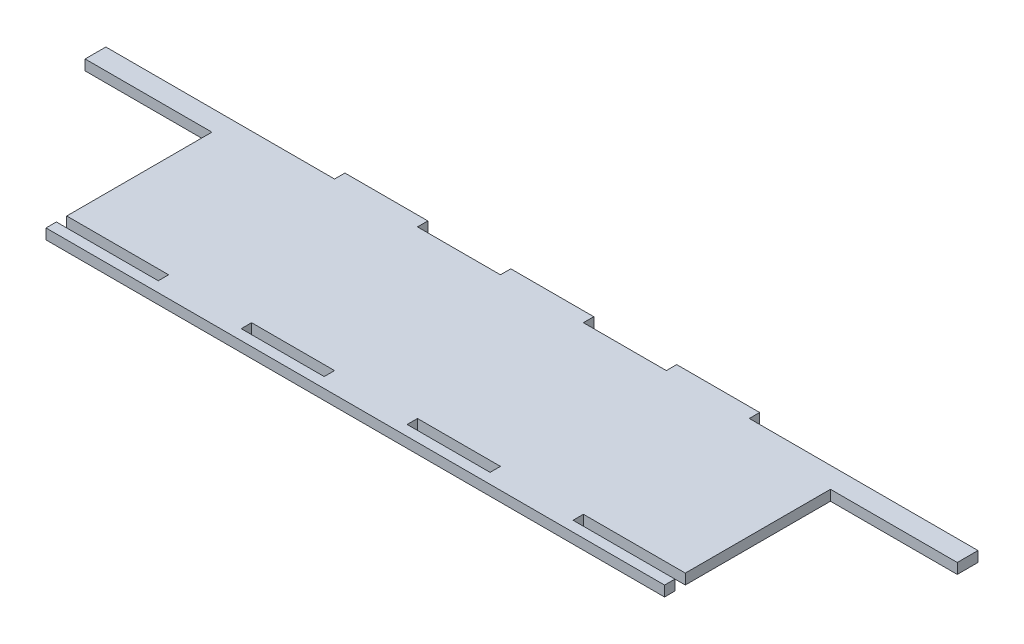
ISO-10303-21;
HEADER;
FILE_DESCRIPTION(('STEP AP214'),'2;1');
FILE_NAME('part.step','',(''),(''),'','','');
FILE_SCHEMA(('AUTOMOTIVE_DESIGN { 1 0 10303 214 1 1 1 1 }'));
ENDSEC;
DATA;
#1=APPLICATION_CONTEXT('core data for automotive mechanical design processes');
#2=APPLICATION_PROTOCOL_DEFINITION('international standard','automotive_design',2000,#1);
#3=PRODUCT_CONTEXT('',#1,'mechanical');
#4=PRODUCT('Part','Part','',(#3));
#5=PRODUCT_RELATED_PRODUCT_CATEGORY('part','',(#4));
#6=PRODUCT_DEFINITION_FORMATION('','',#4);
#7=PRODUCT_DEFINITION_CONTEXT('part definition',#1,'design');
#8=PRODUCT_DEFINITION('design','',#6,#7);
#9=PRODUCT_DEFINITION_SHAPE('','',#8);
#10=(LENGTH_UNIT() NAMED_UNIT(*) SI_UNIT(.MILLI.,.METRE.));
#11=(NAMED_UNIT(*) PLANE_ANGLE_UNIT() SI_UNIT($,.RADIAN.));
#12=(NAMED_UNIT(*) SI_UNIT($,.STERADIAN.) SOLID_ANGLE_UNIT());
#13=UNCERTAINTY_MEASURE_WITH_UNIT(LENGTH_MEASURE(1.E-05),#10,'distance_accuracy_value','');
#14=(GEOMETRIC_REPRESENTATION_CONTEXT(3) GLOBAL_UNCERTAINTY_ASSIGNED_CONTEXT((#13)) GLOBAL_UNIT_ASSIGNED_CONTEXT((#10,
#11,#12)) REPRESENTATION_CONTEXT('',''));
#15=CARTESIAN_POINT('',(0.,0.,0.));
#16=DIRECTION('',(0.,0.,1.));
#17=DIRECTION('',(1.,0.,0.));
#18=AXIS2_PLACEMENT_3D('',#15,#16,#17);
#19=CARTESIAN_POINT('',(0.,3.175,-19.05));
#20=DIRECTION('',(0.,0.,-1.));
#21=DIRECTION('',(-1.,0.,0.));
#22=AXIS2_PLACEMENT_3D('',#19,#20,#21);
#23=PLANE('',#22);
#24=DIRECTION('',(1.,0.,0.));
#25=VECTOR('',#24,1.);
#26=CARTESIAN_POINT('',(0.,0.,-19.05));
#27=LINE('',#26,#25);
#28=CARTESIAN_POINT('',(-133.525,0.,-19.05));
#29=VERTEX_POINT('',#28);
#30=CARTESIAN_POINT('',(-94.7,0.,-19.05));
#31=VERTEX_POINT('',#30);
#32=EDGE_CURVE('E431',#29,#31,#27,.T.);
#33=ORIENTED_EDGE('',*,*,#32,.T.);
#34=DIRECTION('',(0.,-1.,0.));
#35=VECTOR('',#34,1.);
#36=CARTESIAN_POINT('',(-94.7,3.175,-19.05));
#37=LINE('',#36,#35);
#38=CARTESIAN_POINT('',(-94.7,3.175,-19.05));
#39=VERTEX_POINT('',#38);
#40=EDGE_CURVE('E450',#39,#31,#37,.T.);
#41=ORIENTED_EDGE('',*,*,#40,.F.);
#42=DIRECTION('',(1.,0.,0.));
#43=VECTOR('',#42,1.);
#44=CARTESIAN_POINT('',(0.,3.175,-19.05));
#45=LINE('',#44,#43);
#46=CARTESIAN_POINT('',(-133.525,3.175,-19.05));
#47=VERTEX_POINT('',#46);
#48=EDGE_CURVE('E648',#47,#39,#45,.T.);
#49=ORIENTED_EDGE('',*,*,#48,.F.);
#50=DIRECTION('',(0.,-1.,0.));
#51=VECTOR('',#50,1.);
#52=CARTESIAN_POINT('',(-133.525,3.175,-19.05));
#53=LINE('',#52,#51);
#54=EDGE_CURVE('E453',#47,#29,#53,.T.);
#55=ORIENTED_EDGE('',*,*,#54,.T.);
#56=EDGE_LOOP('',(#33,#41,#49,#55));
#57=FACE_BOUND('',#56,.T.);
#58=ADVANCED_FACE('F223',(#57),#23,.F.);
#59=CARTESIAN_POINT('',(0.,3.175,-19.05));
#60=DIRECTION('',(0.,0.,1.));
#61=DIRECTION('',(1.,0.,0.));
#62=AXIS2_PLACEMENT_3D('',#59,#60,#61);
#63=PLANE('',#62);
#64=DIRECTION('',(-1.,0.,0.));
#65=VECTOR('',#64,1.);
#66=CARTESIAN_POINT('',(0.,0.,-19.05));
#67=LINE('',#66,#65);
#68=CARTESIAN_POINT('',(133.525,0.,-19.05));
#69=VERTEX_POINT('',#68);
#70=CARTESIAN_POINT('',(94.7,0.,-19.05));
#71=VERTEX_POINT('',#70);
#72=EDGE_CURVE('E659',#69,#71,#67,.T.);
#73=ORIENTED_EDGE('',*,*,#72,.F.);
#74=DIRECTION('',(0.,-1.,0.));
#75=VECTOR('',#74,1.);
#76=CARTESIAN_POINT('',(133.525,3.175,-19.05));
#77=LINE('',#76,#75);
#78=CARTESIAN_POINT('',(133.525,3.175,-19.05));
#79=VERTEX_POINT('',#78);
#80=EDGE_CURVE('E462',#79,#69,#77,.T.);
#81=ORIENTED_EDGE('',*,*,#80,.F.);
#82=DIRECTION('',(-1.,0.,0.));
#83=VECTOR('',#82,1.);
#84=CARTESIAN_POINT('',(0.,3.175,-19.05));
#85=LINE('',#84,#83);
#86=CARTESIAN_POINT('',(94.7,3.175,-19.05));
#87=VERTEX_POINT('',#86);
#88=EDGE_CURVE('E841',#79,#87,#85,.T.);
#89=ORIENTED_EDGE('',*,*,#88,.T.);
#90=DIRECTION('',(0.,-1.,0.));
#91=VECTOR('',#90,1.);
#92=CARTESIAN_POINT('',(94.7,3.175,-19.05));
#93=LINE('',#92,#91);
#94=EDGE_CURVE('E465',#87,#71,#93,.T.);
#95=ORIENTED_EDGE('',*,*,#94,.T.);
#96=EDGE_LOOP('',(#73,#81,#89,#95));
#97=FACE_BOUND('',#96,.T.);
#98=ADVANCED_FACE('F863',(#97),#63,.T.);
#99=CARTESIAN_POINT('',(133.525,3.175,0.));
#100=DIRECTION('',(-1.,0.,0.));
#101=DIRECTION('',(0.,0.,1.));
#102=AXIS2_PLACEMENT_3D('',#99,#100,#101);
#103=PLANE('',#102);
#104=DIRECTION('',(0.,0.,-1.));
#105=VECTOR('',#104,1.);
#106=CARTESIAN_POINT('',(133.525,0.,0.));
#107=LINE('',#106,#105);
#108=CARTESIAN_POINT('',(133.525,0.,-25.4));
#109=VERTEX_POINT('',#108);
#110=EDGE_CURVE('E428',#69,#109,#107,.T.);
#111=ORIENTED_EDGE('',*,*,#110,.T.);
#112=DIRECTION('',(0.,-1.,0.));
#113=VECTOR('',#112,1.);
#114=CARTESIAN_POINT('',(133.525,3.175,-25.4));
#115=LINE('',#114,#113);
#116=CARTESIAN_POINT('',(133.525,3.175,-25.4));
#117=VERTEX_POINT('',#116);
#118=EDGE_CURVE('E459',#117,#109,#115,.T.);
#119=ORIENTED_EDGE('',*,*,#118,.F.);
#120=DIRECTION('',(0.,0.,-1.));
#121=VECTOR('',#120,1.);
#122=CARTESIAN_POINT('',(133.525,3.175,0.));
#123=LINE('',#122,#121);
#124=EDGE_CURVE('E640',#79,#117,#123,.T.);
#125=ORIENTED_EDGE('',*,*,#124,.F.);
#126=ORIENTED_EDGE('',*,*,#80,.T.);
#127=EDGE_LOOP('',(#111,#119,#125,#126));
#128=FACE_BOUND('',#127,.T.);
#129=ADVANCED_FACE('F677',(#128),#103,.F.);
#130=CARTESIAN_POINT('',(-133.525,3.175,0.));
#131=DIRECTION('',(-1.,0.,0.));
#132=DIRECTION('',(0.,0.,1.));
#133=AXIS2_PLACEMENT_3D('',#130,#131,#132);
#134=PLANE('',#133);
#135=DIRECTION('',(0.,0.,-1.));
#136=VECTOR('',#135,1.);
#137=CARTESIAN_POINT('',(-133.525,0.,0.));
#138=LINE('',#137,#136);
#139=CARTESIAN_POINT('',(-133.525,0.,-25.4));
#140=VERTEX_POINT('',#139);
#141=EDGE_CURVE('E423',#29,#140,#138,.T.);
#142=ORIENTED_EDGE('',*,*,#141,.F.);
#143=ORIENTED_EDGE('',*,*,#54,.F.);
#144=DIRECTION('',(0.,0.,-1.));
#145=VECTOR('',#144,1.);
#146=CARTESIAN_POINT('',(-133.525,3.175,0.));
#147=LINE('',#146,#145);
#148=CARTESIAN_POINT('',(-133.525,3.175,-25.4));
#149=VERTEX_POINT('',#148);
#150=EDGE_CURVE('E644',#47,#149,#147,.T.);
#151=ORIENTED_EDGE('',*,*,#150,.T.);
#152=DIRECTION('',(0.,-1.,0.));
#153=VECTOR('',#152,1.);
#154=CARTESIAN_POINT('',(-133.525,3.175,-25.4));
#155=LINE('',#154,#153);
#156=EDGE_CURVE('E456',#149,#140,#155,.T.);
#157=ORIENTED_EDGE('',*,*,#156,.T.);
#158=EDGE_LOOP('',(#142,#143,#151,#157));
#159=FACE_BOUND('',#158,.T.);
#160=ADVANCED_FACE('F746',(#159),#134,.T.);
#161=CARTESIAN_POINT('',(94.7,3.175,0.));
#162=DIRECTION('',(1.,0.,0.));
#163=DIRECTION('',(0.,0.,-1.));
#164=AXIS2_PLACEMENT_3D('',#161,#162,#163);
#165=PLANE('',#164);
#166=DIRECTION('',(0.,0.,1.));
#167=VECTOR('',#166,1.);
#168=CARTESIAN_POINT('',(94.7,0.,0.));
#169=LINE('',#168,#167);
#170=CARTESIAN_POINT('',(94.7,0.,25.4));
#171=VERTEX_POINT('',#170);
#172=EDGE_CURVE('E532',#71,#171,#169,.T.);
#173=ORIENTED_EDGE('',*,*,#172,.F.);
#174=ORIENTED_EDGE('',*,*,#94,.F.);
#175=DIRECTION('',(0.,0.,1.));
#176=VECTOR('',#175,1.);
#177=CARTESIAN_POINT('',(94.7,3.175,0.));
#178=LINE('',#177,#176);
#179=CARTESIAN_POINT('',(94.7,3.175,25.4));
#180=VERTEX_POINT('',#179);
#181=EDGE_CURVE('E441',#87,#180,#178,.T.);
#182=ORIENTED_EDGE('',*,*,#181,.T.);
#183=DIRECTION('',(0.,-1.,0.));
#184=VECTOR('',#183,1.);
#185=CARTESIAN_POINT('',(94.7,3.175,25.4));
#186=LINE('',#185,#184);
#187=EDGE_CURVE('E443',#180,#171,#186,.T.);
#188=ORIENTED_EDGE('',*,*,#187,.T.);
#189=EDGE_LOOP('',(#173,#174,#182,#188));
#190=FACE_BOUND('',#189,.T.);
#191=ADVANCED_FACE('F838',(#190),#165,.T.);
#192=CARTESIAN_POINT('',(-94.7,3.175,0.));
#193=DIRECTION('',(1.,0.,0.));
#194=DIRECTION('',(0.,0.,-1.));
#195=AXIS2_PLACEMENT_3D('',#192,#193,#194);
#196=PLANE('',#195);
#197=DIRECTION('',(0.,0.,1.));
#198=VECTOR('',#197,1.);
#199=CARTESIAN_POINT('',(-94.7,0.,0.));
#200=LINE('',#199,#198);
#201=CARTESIAN_POINT('',(-94.7,0.,25.4));
#202=VERTEX_POINT('',#201);
#203=EDGE_CURVE('E434',#31,#202,#200,.T.);
#204=ORIENTED_EDGE('',*,*,#203,.T.);
#205=DIRECTION('',(0.,-1.,0.));
#206=VECTOR('',#205,1.);
#207=CARTESIAN_POINT('',(-94.7,3.175,25.4));
#208=LINE('',#207,#206);
#209=CARTESIAN_POINT('',(-94.7,3.175,25.4));
#210=VERTEX_POINT('',#209);
#211=EDGE_CURVE('E446',#210,#202,#208,.T.);
#212=ORIENTED_EDGE('',*,*,#211,.F.);
#213=DIRECTION('',(0.,0.,1.));
#214=VECTOR('',#213,1.);
#215=CARTESIAN_POINT('',(-94.7,3.175,0.));
#216=LINE('',#215,#214);
#217=EDGE_CURVE('E651',#39,#210,#216,.T.);
#218=ORIENTED_EDGE('',*,*,#217,.F.);
#219=ORIENTED_EDGE('',*,*,#40,.T.);
#220=EDGE_LOOP('',(#204,#212,#218,#219));
#221=FACE_BOUND('',#220,.T.);
#222=ADVANCED_FACE('F755',(#221),#196,.F.);
#223=CARTESIAN_POINT('',(0.,0.,0.));
#224=DIRECTION('',(0.,1.,0.));
#225=DIRECTION('',(0.,0.,1.));
#226=AXIS2_PLACEMENT_3D('',#223,#224,#225);
#227=PLANE('',#226);
#228=DIRECTION('',(0.,0.,1.));
#229=VECTOR('',#228,1.);
#230=CARTESIAN_POINT('',(63.5,0.,25.4));
#231=LINE('',#230,#229);
#232=CARTESIAN_POINT('',(63.5,0.,25.4));
#233=VERTEX_POINT('',#232);
#234=CARTESIAN_POINT('',(63.5,0.,28.575));
#235=VERTEX_POINT('',#234);
#236=EDGE_CURVE('E561',#233,#235,#231,.T.);
#237=ORIENTED_EDGE('',*,*,#236,.T.);
#238=DIRECTION('',(1.,0.,0.));
#239=VECTOR('',#238,1.);
#240=CARTESIAN_POINT('',(0.,0.,28.575));
#241=LINE('',#240,#239);
#242=CARTESIAN_POINT('',(94.7,0.,28.575));
#243=VERTEX_POINT('',#242);
#244=EDGE_CURVE('E492',#235,#243,#241,.T.);
#245=ORIENTED_EDGE('',*,*,#244,.T.);
#246=DIRECTION('',(0.,0.,-1.));
#247=VECTOR('',#246,1.);
#248=CARTESIAN_POINT('',(94.7000000000001,0.,4.1392960800001E-13));
#249=LINE('',#248,#247);
#250=CARTESIAN_POINT('',(94.7,0.,31.75));
#251=VERTEX_POINT('',#250);
#252=EDGE_CURVE('E488',#251,#243,#249,.T.);
#253=ORIENTED_EDGE('',*,*,#252,.F.);
#254=DIRECTION('',(1.,0.,0.));
#255=VECTOR('',#254,1.);
#256=CARTESIAN_POINT('',(0.,0.,31.75));
#257=LINE('',#256,#255);
#258=CARTESIAN_POINT('',(-94.7,0.,31.75));
#259=VERTEX_POINT('',#258);
#260=EDGE_CURVE('E485',#259,#251,#257,.T.);
#261=ORIENTED_EDGE('',*,*,#260,.F.);
#262=DIRECTION('',(0.,0.,-1.));
#263=VECTOR('',#262,1.);
#264=CARTESIAN_POINT('',(-94.7000000000001,0.,4.1392960800001E-13));
#265=LINE('',#264,#263);
#266=CARTESIAN_POINT('',(-94.7,0.,28.575));
#267=VERTEX_POINT('',#266);
#268=EDGE_CURVE('E473',#259,#267,#265,.T.);
#269=ORIENTED_EDGE('',*,*,#268,.T.);
#270=CARTESIAN_POINT('',(-63.5,0.,28.575));
#271=VERTEX_POINT('',#270);
#272=EDGE_CURVE('E493',#267,#271,#241,.T.);
#273=ORIENTED_EDGE('',*,*,#272,.T.);
#274=DIRECTION('',(0.,0.,1.));
#275=VECTOR('',#274,1.);
#276=CARTESIAN_POINT('',(-63.5,0.,25.4));
#277=LINE('',#276,#275);
#278=CARTESIAN_POINT('',(-63.5,0.,25.4));
#279=VERTEX_POINT('',#278);
#280=EDGE_CURVE('E512',#279,#271,#277,.T.);
#281=ORIENTED_EDGE('',*,*,#280,.F.);
#282=DIRECTION('',(1.,0.,0.));
#283=VECTOR('',#282,1.);
#284=CARTESIAN_POINT('',(0.,0.,25.4));
#285=LINE('',#284,#283);
#286=EDGE_CURVE('E438',#202,#279,#285,.T.);
#287=ORIENTED_EDGE('',*,*,#286,.F.);
#288=ORIENTED_EDGE('',*,*,#203,.F.);
#289=ORIENTED_EDGE('',*,*,#32,.F.);
#290=ORIENTED_EDGE('',*,*,#141,.T.);
#291=DIRECTION('',(1.,0.,0.));
#292=VECTOR('',#291,1.);
#293=CARTESIAN_POINT('',(0.,0.,-25.4));
#294=LINE('',#293,#292);
#295=CARTESIAN_POINT('',(-63.5,0.,-25.4));
#296=VERTEX_POINT('',#295);
#297=EDGE_CURVE('E371',#140,#296,#294,.T.);
#298=ORIENTED_EDGE('',*,*,#297,.T.);
#299=DIRECTION('',(0.,0.,-1.));
#300=VECTOR('',#299,1.);
#301=CARTESIAN_POINT('',(-63.5,0.,-25.4));
#302=LINE('',#301,#300);
#303=CARTESIAN_POINT('',(-63.5,0.,-28.575));
#304=VERTEX_POINT('',#303);
#305=EDGE_CURVE('E353',#296,#304,#302,.T.);
#306=ORIENTED_EDGE('',*,*,#305,.T.);
#307=DIRECTION('',(1.,0.,0.));
#308=VECTOR('',#307,1.);
#309=CARTESIAN_POINT('',(-63.5,0.,-28.575));
#310=LINE('',#309,#308);
#311=CARTESIAN_POINT('',(-38.1,0.,-28.575));
#312=VERTEX_POINT('',#311);
#313=EDGE_CURVE('E361',#304,#312,#310,.T.);
#314=ORIENTED_EDGE('',*,*,#313,.T.);
#315=DIRECTION('',(0.,0.,-1.));
#316=VECTOR('',#315,1.);
#317=CARTESIAN_POINT('',(-38.1,0.,-25.4));
#318=LINE('',#317,#316);
#319=CARTESIAN_POINT('',(-38.1,0.,-25.4));
#320=VERTEX_POINT('',#319);
#321=EDGE_CURVE('E364',#320,#312,#318,.T.);
#322=ORIENTED_EDGE('',*,*,#321,.F.);
#323=CARTESIAN_POINT('',(-12.7,0.,-25.4));
#324=VERTEX_POINT('',#323);
#325=EDGE_CURVE('E418',#320,#324,#294,.T.);
#326=ORIENTED_EDGE('',*,*,#325,.T.);
#327=DIRECTION('',(0.,0.,-1.));
#328=VECTOR('',#327,1.);
#329=CARTESIAN_POINT('',(-12.7,0.,-25.4));
#330=LINE('',#329,#328);
#331=CARTESIAN_POINT('',(-12.7,0.,-28.575));
#332=VERTEX_POINT('',#331);
#333=EDGE_CURVE('E598',#324,#332,#330,.T.);
#334=ORIENTED_EDGE('',*,*,#333,.T.);
#335=DIRECTION('',(1.,0.,0.));
#336=VECTOR('',#335,1.);
#337=CARTESIAN_POINT('',(-12.7,0.,-28.575));
#338=LINE('',#337,#336);
#339=CARTESIAN_POINT('',(12.7,0.,-28.575));
#340=VERTEX_POINT('',#339);
#341=EDGE_CURVE('E358',#332,#340,#338,.T.);
#342=ORIENTED_EDGE('',*,*,#341,.T.);
#343=DIRECTION('',(0.,0.,-1.));
#344=VECTOR('',#343,1.);
#345=CARTESIAN_POINT('',(12.7,0.,-25.4));
#346=LINE('',#345,#344);
#347=CARTESIAN_POINT('',(12.7,0.,-25.4));
#348=VERTEX_POINT('',#347);
#349=EDGE_CURVE('E604',#348,#340,#346,.T.);
#350=ORIENTED_EDGE('',*,*,#349,.F.);
#351=CARTESIAN_POINT('',(38.1,0.,-25.4));
#352=VERTEX_POINT('',#351);
#353=EDGE_CURVE('E421',#348,#352,#294,.T.);
#354=ORIENTED_EDGE('',*,*,#353,.T.);
#355=DIRECTION('',(0.,0.,-1.));
#356=VECTOR('',#355,1.);
#357=CARTESIAN_POINT('',(38.1,0.,-25.4));
#358=LINE('',#357,#356);
#359=CARTESIAN_POINT('',(38.1,0.,-28.575));
#360=VERTEX_POINT('',#359);
#361=EDGE_CURVE('E576',#352,#360,#358,.T.);
#362=ORIENTED_EDGE('',*,*,#361,.T.);
#363=DIRECTION('',(1.,0.,0.));
#364=VECTOR('',#363,1.);
#365=CARTESIAN_POINT('',(38.1,0.,-28.575));
#366=LINE('',#365,#364);
#367=CARTESIAN_POINT('',(63.5,0.,-28.575));
#368=VERTEX_POINT('',#367);
#369=EDGE_CURVE('E582',#360,#368,#366,.T.);
#370=ORIENTED_EDGE('',*,*,#369,.T.);
#371=DIRECTION('',(0.,0.,-1.));
#372=VECTOR('',#371,1.);
#373=CARTESIAN_POINT('',(63.5,0.,-25.4));
#374=LINE('',#373,#372);
#375=CARTESIAN_POINT('',(63.5,0.,-25.4));
#376=VERTEX_POINT('',#375);
#377=EDGE_CURVE('E585',#376,#368,#374,.T.);
#378=ORIENTED_EDGE('',*,*,#377,.F.);
#379=EDGE_CURVE('E424',#376,#109,#294,.T.);
#380=ORIENTED_EDGE('',*,*,#379,.T.);
#381=ORIENTED_EDGE('',*,*,#110,.F.);
#382=ORIENTED_EDGE('',*,*,#72,.T.);
#383=ORIENTED_EDGE('',*,*,#172,.T.);
#384=EDGE_CURVE('E437',#233,#171,#285,.T.);
#385=ORIENTED_EDGE('',*,*,#384,.F.);
#386=EDGE_LOOP('',(#237,#245,#253,#261,#269,#273,#281,#287,#288,#289,#290,#298,#306,#314,#322,
#326,#334,#342,#350,#354,#362,#370,#378,#380,#381,#382,#383,#385));
#387=FACE_BOUND('',#386,.T.);
#388=DIRECTION('',(0.,0.,1.));
#389=VECTOR('',#388,1.);
#390=CARTESIAN_POINT('',(12.7,0.,25.4));
#391=LINE('',#390,#389);
#392=CARTESIAN_POINT('',(12.7,0.,25.4));
#393=VERTEX_POINT('',#392);
#394=CARTESIAN_POINT('',(12.7,0.,28.575));
#395=VERTEX_POINT('',#394);
#396=EDGE_CURVE('E539',#393,#395,#391,.T.);
#397=ORIENTED_EDGE('',*,*,#396,.T.);
#398=CARTESIAN_POINT('',(38.1,0.,28.575));
#399=VERTEX_POINT('',#398);
#400=EDGE_CURVE('E806',#395,#399,#241,.T.);
#401=ORIENTED_EDGE('',*,*,#400,.T.);
#402=DIRECTION('',(0.,0.,1.));
#403=VECTOR('',#402,1.);
#404=CARTESIAN_POINT('',(38.1,0.,25.4));
#405=LINE('',#404,#403);
#406=CARTESIAN_POINT('',(38.1,0.,25.4));
#407=VERTEX_POINT('',#406);
#408=EDGE_CURVE('E558',#407,#399,#405,.T.);
#409=ORIENTED_EDGE('',*,*,#408,.F.);
#410=EDGE_CURVE('E830',#393,#407,#285,.T.);
#411=ORIENTED_EDGE('',*,*,#410,.F.);
#412=EDGE_LOOP('',(#397,#401,#409,#411));
#413=FACE_BOUND('',#412,.T.);
#414=CARTESIAN_POINT('',(-38.1,0.,28.575));
#415=VERTEX_POINT('',#414);
#416=CARTESIAN_POINT('',(-12.7,0.,28.575));
#417=VERTEX_POINT('',#416);
#418=EDGE_CURVE('E496',#415,#417,#241,.T.);
#419=ORIENTED_EDGE('',*,*,#418,.T.);
#420=DIRECTION('',(0.,0.,1.));
#421=VECTOR('',#420,1.);
#422=CARTESIAN_POINT('',(-12.7,0.,25.4));
#423=LINE('',#422,#421);
#424=CARTESIAN_POINT('',(-12.7,0.,25.4));
#425=VERTEX_POINT('',#424);
#426=EDGE_CURVE('E536',#425,#417,#423,.T.);
#427=ORIENTED_EDGE('',*,*,#426,.F.);
#428=CARTESIAN_POINT('',(-38.1,0.,25.4));
#429=VERTEX_POINT('',#428);
#430=EDGE_CURVE('E442',#429,#425,#285,.T.);
#431=ORIENTED_EDGE('',*,*,#430,.F.);
#432=DIRECTION('',(0.,0.,1.));
#433=VECTOR('',#432,1.);
#434=CARTESIAN_POINT('',(-38.1,0.,25.4));
#435=LINE('',#434,#433);
#436=EDGE_CURVE('E515',#429,#415,#435,.T.);
#437=ORIENTED_EDGE('',*,*,#436,.T.);
#438=EDGE_LOOP('',(#419,#427,#431,#437));
#439=FACE_BOUND('',#438,.T.);
#440=ADVANCED_FACE('F367',(#387,#413,#439),#227,.F.);
#441=CARTESIAN_POINT('',(0.,3.175,0.));
#442=DIRECTION('',(0.,1.,0.));
#443=DIRECTION('',(0.,0.,1.));
#444=AXIS2_PLACEMENT_3D('',#441,#442,#443);
#445=PLANE('',#444);
#446=DIRECTION('',(1.,0.,0.));
#447=VECTOR('',#446,1.);
#448=CARTESIAN_POINT('',(0.,3.175,28.575));
#449=LINE('',#448,#447);
#450=CARTESIAN_POINT('',(63.5,3.175,28.575));
#451=VERTEX_POINT('',#450);
#452=CARTESIAN_POINT('',(94.7,3.175,28.575));
#453=VERTEX_POINT('',#452);
#454=EDGE_CURVE('E476',#451,#453,#449,.T.);
#455=ORIENTED_EDGE('',*,*,#454,.F.);
#456=DIRECTION('',(0.,0.,1.));
#457=VECTOR('',#456,1.);
#458=CARTESIAN_POINT('',(63.5,3.175,25.4));
#459=LINE('',#458,#457);
#460=CARTESIAN_POINT('',(63.5,3.175,25.4));
#461=VERTEX_POINT('',#460);
#462=EDGE_CURVE('E555',#461,#451,#459,.T.);
#463=ORIENTED_EDGE('',*,*,#462,.F.);
#464=DIRECTION('',(1.,0.,0.));
#465=VECTOR('',#464,1.);
#466=CARTESIAN_POINT('',(0.,3.175,25.4));
#467=LINE('',#466,#465);
#468=EDGE_CURVE('E654',#461,#180,#467,.T.);
#469=ORIENTED_EDGE('',*,*,#468,.T.);
#470=ORIENTED_EDGE('',*,*,#181,.F.);
#471=ORIENTED_EDGE('',*,*,#88,.F.);
#472=ORIENTED_EDGE('',*,*,#124,.T.);
#473=DIRECTION('',(1.,0.,0.));
#474=VECTOR('',#473,1.);
#475=CARTESIAN_POINT('',(0.,3.175,-25.4));
#476=LINE('',#475,#474);
#477=CARTESIAN_POINT('',(63.5,3.175,-25.4));
#478=VERTEX_POINT('',#477);
#479=EDGE_CURVE('E637',#478,#117,#476,.T.);
#480=ORIENTED_EDGE('',*,*,#479,.F.);
#481=DIRECTION('',(0.,0.,-1.));
#482=VECTOR('',#481,1.);
#483=CARTESIAN_POINT('',(63.5,3.175,-25.4));
#484=LINE('',#483,#482);
#485=CARTESIAN_POINT('',(63.5,3.175,-28.575));
#486=VERTEX_POINT('',#485);
#487=EDGE_CURVE('E575',#478,#486,#484,.T.);
#488=ORIENTED_EDGE('',*,*,#487,.T.);
#489=DIRECTION('',(1.,0.,0.));
#490=VECTOR('',#489,1.);
#491=CARTESIAN_POINT('',(38.1,3.175,-28.575));
#492=LINE('',#491,#490);
#493=CARTESIAN_POINT('',(38.1,3.175,-28.575));
#494=VERTEX_POINT('',#493);
#495=EDGE_CURVE('E572',#494,#486,#492,.T.);
#496=ORIENTED_EDGE('',*,*,#495,.F.);
#497=DIRECTION('',(0.,0.,-1.));
#498=VECTOR('',#497,1.);
#499=CARTESIAN_POINT('',(38.1,3.175,-25.4));
#500=LINE('',#499,#498);
#501=CARTESIAN_POINT('',(38.1,3.175,-25.4));
#502=VERTEX_POINT('',#501);
#503=EDGE_CURVE('E578',#502,#494,#500,.T.);
#504=ORIENTED_EDGE('',*,*,#503,.F.);
#505=CARTESIAN_POINT('',(12.7,3.175,-25.4));
#506=VERTEX_POINT('',#505);
#507=EDGE_CURVE('E630',#506,#502,#476,.T.);
#508=ORIENTED_EDGE('',*,*,#507,.F.);
#509=DIRECTION('',(0.,0.,-1.));
#510=VECTOR('',#509,1.);
#511=CARTESIAN_POINT('',(12.7,3.175,-25.4));
#512=LINE('',#511,#510);
#513=CARTESIAN_POINT('',(12.7,3.175,-28.575));
#514=VERTEX_POINT('',#513);
#515=EDGE_CURVE('E597',#506,#514,#512,.T.);
#516=ORIENTED_EDGE('',*,*,#515,.T.);
#517=DIRECTION('',(1.,0.,0.));
#518=VECTOR('',#517,1.);
#519=CARTESIAN_POINT('',(-12.7,3.175,-28.575));
#520=LINE('',#519,#518);
#521=CARTESIAN_POINT('',(-12.7,3.175,-28.575));
#522=VERTEX_POINT('',#521);
#523=EDGE_CURVE('E594',#522,#514,#520,.T.);
#524=ORIENTED_EDGE('',*,*,#523,.F.);
#525=DIRECTION('',(0.,0.,-1.));
#526=VECTOR('',#525,1.);
#527=CARTESIAN_POINT('',(-12.7,3.175,-25.4));
#528=LINE('',#527,#526);
#529=CARTESIAN_POINT('',(-12.7,3.175,-25.4));
#530=VERTEX_POINT('',#529);
#531=EDGE_CURVE('E404',#530,#522,#528,.T.);
#532=ORIENTED_EDGE('',*,*,#531,.F.);
#533=CARTESIAN_POINT('',(-38.1,3.175,-25.4));
#534=VERTEX_POINT('',#533);
#535=EDGE_CURVE('E414',#534,#530,#476,.T.);
#536=ORIENTED_EDGE('',*,*,#535,.F.);
#537=DIRECTION('',(0.,0.,-1.));
#538=VECTOR('',#537,1.);
#539=CARTESIAN_POINT('',(-38.1,3.175,-25.4));
#540=LINE('',#539,#538);
#541=CARTESIAN_POINT('',(-38.1,3.175,-28.575));
#542=VERTEX_POINT('',#541);
#543=EDGE_CURVE('E374',#534,#542,#540,.T.);
#544=ORIENTED_EDGE('',*,*,#543,.T.);
#545=DIRECTION('',(1.,0.,0.));
#546=VECTOR('',#545,1.);
#547=CARTESIAN_POINT('',(-63.5,3.175,-28.575));
#548=LINE('',#547,#546);
#549=CARTESIAN_POINT('',(-63.5,3.175,-28.575));
#550=VERTEX_POINT('',#549);
#551=EDGE_CURVE('E372',#550,#542,#548,.T.);
#552=ORIENTED_EDGE('',*,*,#551,.F.);
#553=DIRECTION('',(0.,0.,-1.));
#554=VECTOR('',#553,1.);
#555=CARTESIAN_POINT('',(-63.5,3.175,-25.4));
#556=LINE('',#555,#554);
#557=CARTESIAN_POINT('',(-63.5,3.175,-25.4));
#558=VERTEX_POINT('',#557);
#559=EDGE_CURVE('E356',#558,#550,#556,.T.);
#560=ORIENTED_EDGE('',*,*,#559,.F.);
#561=EDGE_CURVE('E639',#149,#558,#476,.T.);
#562=ORIENTED_EDGE('',*,*,#561,.F.);
#563=ORIENTED_EDGE('',*,*,#150,.F.);
#564=ORIENTED_EDGE('',*,*,#48,.T.);
#565=ORIENTED_EDGE('',*,*,#217,.T.);
#566=CARTESIAN_POINT('',(-63.5,3.175,25.4));
#567=VERTEX_POINT('',#566);
#568=EDGE_CURVE('E447',#210,#567,#467,.T.);
#569=ORIENTED_EDGE('',*,*,#568,.T.);
#570=DIRECTION('',(0.,0.,1.));
#571=VECTOR('',#570,1.);
#572=CARTESIAN_POINT('',(-63.5,3.175,25.4));
#573=LINE('',#572,#571);
#574=CARTESIAN_POINT('',(-63.5,3.175,28.575));
#575=VERTEX_POINT('',#574);
#576=EDGE_CURVE('E489',#567,#575,#573,.T.);
#577=ORIENTED_EDGE('',*,*,#576,.T.);
#578=CARTESIAN_POINT('',(-94.7,3.175,28.575));
#579=VERTEX_POINT('',#578);
#580=EDGE_CURVE('E477',#579,#575,#449,.T.);
#581=ORIENTED_EDGE('',*,*,#580,.F.);
#582=DIRECTION('',(0.,0.,-1.));
#583=VECTOR('',#582,1.);
#584=CARTESIAN_POINT('',(-94.7000000000001,3.175,4.1392960800001E-13));
#585=LINE('',#584,#583);
#586=CARTESIAN_POINT('',(-94.7,3.175,31.75));
#587=VERTEX_POINT('',#586);
#588=EDGE_CURVE('E480',#587,#579,#585,.T.);
#589=ORIENTED_EDGE('',*,*,#588,.F.);
#590=DIRECTION('',(1.,0.,0.));
#591=VECTOR('',#590,1.);
#592=CARTESIAN_POINT('',(0.,3.175,31.75));
#593=LINE('',#592,#591);
#594=CARTESIAN_POINT('',(94.7,3.175,31.75));
#595=VERTEX_POINT('',#594);
#596=EDGE_CURVE('E469',#587,#595,#593,.T.);
#597=ORIENTED_EDGE('',*,*,#596,.T.);
#598=DIRECTION('',(0.,0.,-1.));
#599=VECTOR('',#598,1.);
#600=CARTESIAN_POINT('',(94.7000000000001,3.175,4.1392960800001E-13));
#601=LINE('',#600,#599);
#602=EDGE_CURVE('E472',#595,#453,#601,.T.);
#603=ORIENTED_EDGE('',*,*,#602,.T.);
#604=EDGE_LOOP('',(#455,#463,#469,#470,#471,#472,#480,#488,#496,#504,#508,#516,#524,#532,#536,
#544,#552,#560,#562,#563,#564,#565,#569,#577,#581,#589,#597,#603));
#605=FACE_BOUND('',#604,.T.);
#606=CARTESIAN_POINT('',(12.7,3.175,28.575));
#607=VERTEX_POINT('',#606);
#608=CARTESIAN_POINT('',(38.1,3.175,28.575));
#609=VERTEX_POINT('',#608);
#610=EDGE_CURVE('E784',#607,#609,#449,.T.);
#611=ORIENTED_EDGE('',*,*,#610,.F.);
#612=DIRECTION('',(0.,0.,1.));
#613=VECTOR('',#612,1.);
#614=CARTESIAN_POINT('',(12.7,3.175,25.4));
#615=LINE('',#614,#613);
#616=CARTESIAN_POINT('',(12.7,3.175,25.4));
#617=VERTEX_POINT('',#616);
#618=EDGE_CURVE('E533',#617,#607,#615,.T.);
#619=ORIENTED_EDGE('',*,*,#618,.F.);
#620=CARTESIAN_POINT('',(38.1,3.175,25.4));
#621=VERTEX_POINT('',#620);
#622=EDGE_CURVE('E820',#617,#621,#467,.T.);
#623=ORIENTED_EDGE('',*,*,#622,.T.);
#624=DIRECTION('',(0.,0.,1.));
#625=VECTOR('',#624,1.);
#626=CARTESIAN_POINT('',(38.1,3.175,25.4));
#627=LINE('',#626,#625);
#628=EDGE_CURVE('E542',#621,#609,#627,.T.);
#629=ORIENTED_EDGE('',*,*,#628,.T.);
#630=EDGE_LOOP('',(#611,#619,#623,#629));
#631=FACE_BOUND('',#630,.T.);
#632=DIRECTION('',(0.,0.,1.));
#633=VECTOR('',#632,1.);
#634=CARTESIAN_POINT('',(-12.7,3.175,25.4));
#635=LINE('',#634,#633);
#636=CARTESIAN_POINT('',(-12.7,3.175,25.4));
#637=VERTEX_POINT('',#636);
#638=CARTESIAN_POINT('',(-12.7,3.175,28.575));
#639=VERTEX_POINT('',#638);
#640=EDGE_CURVE('E518',#637,#639,#635,.T.);
#641=ORIENTED_EDGE('',*,*,#640,.T.);
#642=CARTESIAN_POINT('',(-38.1,3.175,28.575));
#643=VERTEX_POINT('',#642);
#644=EDGE_CURVE('E481',#643,#639,#449,.T.);
#645=ORIENTED_EDGE('',*,*,#644,.F.);
#646=DIRECTION('',(0.,0.,1.));
#647=VECTOR('',#646,1.);
#648=CARTESIAN_POINT('',(-38.1,3.175,25.4));
#649=LINE('',#648,#647);
#650=CARTESIAN_POINT('',(-38.1,3.175,25.4));
#651=VERTEX_POINT('',#650);
#652=EDGE_CURVE('E509',#651,#643,#649,.T.);
#653=ORIENTED_EDGE('',*,*,#652,.F.);
#654=EDGE_CURVE('E657',#651,#637,#467,.T.);
#655=ORIENTED_EDGE('',*,*,#654,.T.);
#656=EDGE_LOOP('',(#641,#645,#653,#655));
#657=FACE_BOUND('',#656,.T.);
#658=ADVANCED_FACE('F410',(#605,#631,#657),#445,.T.);
#659=CARTESIAN_POINT('',(0.,3.175,25.4));
#660=DIRECTION('',(0.,0.,-1.));
#661=DIRECTION('',(-1.,0.,0.));
#662=AXIS2_PLACEMENT_3D('',#659,#660,#661);
#663=PLANE('',#662);
#664=DIRECTION('',(0.,-1.,0.));
#665=VECTOR('',#664,1.);
#666=CARTESIAN_POINT('',(-12.7,3.175,25.4));
#667=LINE('',#666,#665);
#668=EDGE_CURVE('E548',#637,#425,#667,.T.);
#669=ORIENTED_EDGE('',*,*,#668,.F.);
#670=ORIENTED_EDGE('',*,*,#654,.F.);
#671=DIRECTION('',(0.,-1.,0.));
#672=VECTOR('',#671,1.);
#673=CARTESIAN_POINT('',(-38.1,3.175,25.4));
#674=LINE('',#673,#672);
#675=EDGE_CURVE('E468',#651,#429,#674,.T.);
#676=ORIENTED_EDGE('',*,*,#675,.T.);
#677=ORIENTED_EDGE('',*,*,#430,.T.);
#678=EDGE_LOOP('',(#669,#670,#676,#677));
#679=FACE_BOUND('',#678,.T.);
#680=ADVANCED_FACE('F1102',(#679),#663,.F.);
#681=DIRECTION('',(0.,-1.,0.));
#682=VECTOR('',#681,1.);
#683=CARTESIAN_POINT('',(-63.5,3.175,25.4));
#684=LINE('',#683,#682);
#685=EDGE_CURVE('E525',#567,#279,#684,.T.);
#686=ORIENTED_EDGE('',*,*,#685,.F.);
#687=ORIENTED_EDGE('',*,*,#568,.F.);
#688=ORIENTED_EDGE('',*,*,#211,.T.);
#689=ORIENTED_EDGE('',*,*,#286,.T.);
#690=EDGE_LOOP('',(#686,#687,#688,#689));
#691=FACE_BOUND('',#690,.T.);
#692=ADVANCED_FACE('F759',(#691),#663,.F.);
#693=DIRECTION('',(0.,-1.,0.));
#694=VECTOR('',#693,1.);
#695=CARTESIAN_POINT('',(38.1,3.175,25.4));
#696=LINE('',#695,#694);
#697=EDGE_CURVE('E381',#621,#407,#696,.T.);
#698=ORIENTED_EDGE('',*,*,#697,.F.);
#699=ORIENTED_EDGE('',*,*,#622,.F.);
#700=DIRECTION('',(0.,-1.,0.));
#701=VECTOR('',#700,1.);
#702=CARTESIAN_POINT('',(12.7,3.175,25.4));
#703=LINE('',#702,#701);
#704=EDGE_CURVE('E528',#617,#393,#703,.T.);
#705=ORIENTED_EDGE('',*,*,#704,.T.);
#706=ORIENTED_EDGE('',*,*,#410,.T.);
#707=EDGE_LOOP('',(#698,#699,#705,#706));
#708=FACE_BOUND('',#707,.T.);
#709=ADVANCED_FACE('F826',(#708),#663,.F.);
#710=ORIENTED_EDGE('',*,*,#468,.F.);
#711=DIRECTION('',(0.,-1.,0.));
#712=VECTOR('',#711,1.);
#713=CARTESIAN_POINT('',(63.5,3.175,25.4));
#714=LINE('',#713,#712);
#715=EDGE_CURVE('E551',#461,#233,#714,.T.);
#716=ORIENTED_EDGE('',*,*,#715,.T.);
#717=ORIENTED_EDGE('',*,*,#384,.T.);
#718=ORIENTED_EDGE('',*,*,#187,.F.);
#719=EDGE_LOOP('',(#710,#716,#717,#718));
#720=FACE_BOUND('',#719,.T.);
#721=ADVANCED_FACE('F818',(#720),#663,.F.);
#722=CARTESIAN_POINT('',(0.,3.175,-25.4));
#723=DIRECTION('',(0.,0.,-1.));
#724=DIRECTION('',(-1.,0.,0.));
#725=AXIS2_PLACEMENT_3D('',#722,#723,#724);
#726=PLANE('',#725);
#727=ORIENTED_EDGE('',*,*,#561,.T.);
#728=DIRECTION('',(0.,-1.,0.));
#729=VECTOR('',#728,1.);
#730=CARTESIAN_POINT('',(-63.5,3.175,-25.4));
#731=LINE('',#730,#729);
#732=EDGE_CURVE('E378',#558,#296,#731,.T.);
#733=ORIENTED_EDGE('',*,*,#732,.T.);
#734=ORIENTED_EDGE('',*,*,#297,.F.);
#735=ORIENTED_EDGE('',*,*,#156,.F.);
#736=EDGE_LOOP('',(#727,#733,#734,#735));
#737=FACE_BOUND('',#736,.T.);
#738=ADVANCED_FACE('F741',(#737),#726,.T.);
#739=ORIENTED_EDGE('',*,*,#535,.T.);
#740=DIRECTION('',(0.,-1.,0.));
#741=VECTOR('',#740,1.);
#742=CARTESIAN_POINT('',(-12.7,3.175,-25.4));
#743=LINE('',#742,#741);
#744=EDGE_CURVE('E383',#530,#324,#743,.T.);
#745=ORIENTED_EDGE('',*,*,#744,.T.);
#746=ORIENTED_EDGE('',*,*,#325,.F.);
#747=DIRECTION('',(0.,-1.,0.));
#748=VECTOR('',#747,1.);
#749=CARTESIAN_POINT('',(-38.1,3.175,-25.4));
#750=LINE('',#749,#748);
#751=EDGE_CURVE('E380',#534,#320,#750,.T.);
#752=ORIENTED_EDGE('',*,*,#751,.F.);
#753=EDGE_LOOP('',(#739,#745,#746,#752));
#754=FACE_BOUND('',#753,.T.);
#755=ADVANCED_FACE('F420',(#754),#726,.T.);
#756=ORIENTED_EDGE('',*,*,#507,.T.);
#757=DIRECTION('',(0.,-1.,0.));
#758=VECTOR('',#757,1.);
#759=CARTESIAN_POINT('',(38.1,3.175,-25.4));
#760=LINE('',#759,#758);
#761=EDGE_CURVE('E233',#502,#352,#760,.T.);
#762=ORIENTED_EDGE('',*,*,#761,.T.);
#763=ORIENTED_EDGE('',*,*,#353,.F.);
#764=DIRECTION('',(0.,-1.,0.));
#765=VECTOR('',#764,1.);
#766=CARTESIAN_POINT('',(12.7,3.175,-25.4));
#767=LINE('',#766,#765);
#768=EDGE_CURVE('E389',#506,#348,#767,.T.);
#769=ORIENTED_EDGE('',*,*,#768,.F.);
#770=EDGE_LOOP('',(#756,#762,#763,#769));
#771=FACE_BOUND('',#770,.T.);
#772=ADVANCED_FACE('F628',(#771),#726,.T.);
#773=DIRECTION('',(0.,-1.,0.));
#774=VECTOR('',#773,1.);
#775=CARTESIAN_POINT('',(63.5,3.175,-25.4));
#776=LINE('',#775,#774);
#777=EDGE_CURVE('E12',#478,#376,#776,.T.);
#778=ORIENTED_EDGE('',*,*,#777,.F.);
#779=ORIENTED_EDGE('',*,*,#479,.T.);
#780=ORIENTED_EDGE('',*,*,#118,.T.);
#781=ORIENTED_EDGE('',*,*,#379,.F.);
#782=EDGE_LOOP('',(#778,#779,#780,#781));
#783=FACE_BOUND('',#782,.T.);
#784=ADVANCED_FACE('F672',(#783),#726,.T.);
#785=CARTESIAN_POINT('',(0.,3.175,31.75));
#786=DIRECTION('',(0.,0.,-1.));
#787=DIRECTION('',(-1.,0.,0.));
#788=AXIS2_PLACEMENT_3D('',#785,#786,#787);
#789=PLANE('',#788);
#790=ORIENTED_EDGE('',*,*,#260,.T.);
#791=DIRECTION('',(0.,-1.,0.));
#792=VECTOR('',#791,1.);
#793=CARTESIAN_POINT('',(94.7,3.175,31.75));
#794=LINE('',#793,#792);
#795=EDGE_CURVE('E505',#595,#251,#794,.T.);
#796=ORIENTED_EDGE('',*,*,#795,.F.);
#797=ORIENTED_EDGE('',*,*,#596,.F.);
#798=DIRECTION('',(0.,-1.,0.));
#799=VECTOR('',#798,1.);
#800=CARTESIAN_POINT('',(-94.7,3.175,31.75));
#801=LINE('',#800,#799);
#802=EDGE_CURVE('E484',#587,#259,#801,.T.);
#803=ORIENTED_EDGE('',*,*,#802,.T.);
#804=EDGE_LOOP('',(#790,#796,#797,#803));
#805=FACE_BOUND('',#804,.T.);
#806=ADVANCED_FACE('F776',(#805),#789,.F.);
#807=CARTESIAN_POINT('',(94.7000000000001,3.175,4.1392960800001E-13));
#808=DIRECTION('',(-1.,0.,0.));
#809=DIRECTION('',(0.,0.,1.));
#810=AXIS2_PLACEMENT_3D('',#807,#808,#809);
#811=PLANE('',#810);
#812=ORIENTED_EDGE('',*,*,#252,.T.);
#813=DIRECTION('',(0.,-1.,0.));
#814=VECTOR('',#813,1.);
#815=CARTESIAN_POINT('',(94.7,3.175,28.575));
#816=LINE('',#815,#814);
#817=EDGE_CURVE('E502',#453,#243,#816,.T.);
#818=ORIENTED_EDGE('',*,*,#817,.F.);
#819=ORIENTED_EDGE('',*,*,#602,.F.);
#820=ORIENTED_EDGE('',*,*,#795,.T.);
#821=EDGE_LOOP('',(#812,#818,#819,#820));
#822=FACE_BOUND('',#821,.T.);
#823=ADVANCED_FACE('F779',(#822),#811,.F.);
#824=CARTESIAN_POINT('',(-94.7000000000001,3.175,4.1392960800001E-13));
#825=DIRECTION('',(-1.,0.,0.));
#826=DIRECTION('',(0.,0.,1.));
#827=AXIS2_PLACEMENT_3D('',#824,#825,#826);
#828=PLANE('',#827);
#829=ORIENTED_EDGE('',*,*,#268,.F.);
#830=ORIENTED_EDGE('',*,*,#802,.F.);
#831=ORIENTED_EDGE('',*,*,#588,.T.);
#832=DIRECTION('',(0.,-1.,0.));
#833=VECTOR('',#832,1.);
#834=CARTESIAN_POINT('',(-94.7,3.175,28.575));
#835=LINE('',#834,#833);
#836=EDGE_CURVE('E500',#579,#267,#835,.T.);
#837=ORIENTED_EDGE('',*,*,#836,.T.);
#838=EDGE_LOOP('',(#829,#830,#831,#837));
#839=FACE_BOUND('',#838,.T.);
#840=ADVANCED_FACE('F771',(#839),#828,.T.);
#841=CARTESIAN_POINT('',(0.,3.175,28.575));
#842=DIRECTION('',(0.,0.,-1.));
#843=DIRECTION('',(-1.,0.,0.));
#844=AXIS2_PLACEMENT_3D('',#841,#842,#843);
#845=PLANE('',#844);
#846=ORIENTED_EDGE('',*,*,#580,.T.);
#847=DIRECTION('',(0.,-1.,0.));
#848=VECTOR('',#847,1.);
#849=CARTESIAN_POINT('',(-63.5,3.175,28.575));
#850=LINE('',#849,#848);
#851=EDGE_CURVE('E521',#575,#271,#850,.T.);
#852=ORIENTED_EDGE('',*,*,#851,.T.);
#853=ORIENTED_EDGE('',*,*,#272,.F.);
#854=ORIENTED_EDGE('',*,*,#836,.F.);
#855=EDGE_LOOP('',(#846,#852,#853,#854));
#856=FACE_BOUND('',#855,.T.);
#857=ADVANCED_FACE('F767',(#856),#845,.T.);
#858=DIRECTION('',(0.,-1.,0.));
#859=VECTOR('',#858,1.);
#860=CARTESIAN_POINT('',(-38.1,3.175,28.575));
#861=LINE('',#860,#859);
#862=EDGE_CURVE('E523',#643,#415,#861,.T.);
#863=ORIENTED_EDGE('',*,*,#862,.F.);
#864=ORIENTED_EDGE('',*,*,#644,.T.);
#865=DIRECTION('',(0.,-1.,0.));
#866=VECTOR('',#865,1.);
#867=CARTESIAN_POINT('',(-12.7,3.175,28.575));
#868=LINE('',#867,#866);
#869=EDGE_CURVE('E545',#639,#417,#868,.T.);
#870=ORIENTED_EDGE('',*,*,#869,.T.);
#871=ORIENTED_EDGE('',*,*,#418,.F.);
#872=EDGE_LOOP('',(#863,#864,#870,#871));
#873=FACE_BOUND('',#872,.T.);
#874=ADVANCED_FACE('F791',(#873),#845,.T.);
#875=CARTESIAN_POINT('',(-38.1,3.175,25.4));
#876=DIRECTION('',(1.,0.,0.));
#877=DIRECTION('',(0.,0.,-1.));
#878=AXIS2_PLACEMENT_3D('',#875,#876,#877);
#879=PLANE('',#878);
#880=ORIENTED_EDGE('',*,*,#436,.F.);
#881=ORIENTED_EDGE('',*,*,#675,.F.);
#882=ORIENTED_EDGE('',*,*,#652,.T.);
#883=ORIENTED_EDGE('',*,*,#862,.T.);
#884=EDGE_LOOP('',(#880,#881,#882,#883));
#885=FACE_BOUND('',#884,.T.);
#886=ADVANCED_FACE('F890',(#885),#879,.T.);
#887=CARTESIAN_POINT('',(-63.5,3.175,25.4));
#888=DIRECTION('',(1.,0.,0.));
#889=DIRECTION('',(0.,0.,-1.));
#890=AXIS2_PLACEMENT_3D('',#887,#888,#889);
#891=PLANE('',#890);
#892=ORIENTED_EDGE('',*,*,#280,.T.);
#893=ORIENTED_EDGE('',*,*,#851,.F.);
#894=ORIENTED_EDGE('',*,*,#576,.F.);
#895=ORIENTED_EDGE('',*,*,#685,.T.);
#896=EDGE_LOOP('',(#892,#893,#894,#895));
#897=FACE_BOUND('',#896,.T.);
#898=ADVANCED_FACE('F763',(#897),#891,.F.);
#899=DIRECTION('',(0.,-1.,0.));
#900=VECTOR('',#899,1.);
#901=CARTESIAN_POINT('',(12.7,3.175,28.575));
#902=LINE('',#901,#900);
#903=EDGE_CURVE('E524',#607,#395,#902,.T.);
#904=ORIENTED_EDGE('',*,*,#903,.F.);
#905=ORIENTED_EDGE('',*,*,#610,.T.);
#906=DIRECTION('',(0.,-1.,0.));
#907=VECTOR('',#906,1.);
#908=CARTESIAN_POINT('',(38.1,3.175,28.575));
#909=LINE('',#908,#907);
#910=EDGE_CURVE('E508',#609,#399,#909,.T.);
#911=ORIENTED_EDGE('',*,*,#910,.T.);
#912=ORIENTED_EDGE('',*,*,#400,.F.);
#913=EDGE_LOOP('',(#904,#905,#911,#912));
#914=FACE_BOUND('',#913,.T.);
#915=ADVANCED_FACE('F833',(#914),#845,.T.);
#916=CARTESIAN_POINT('',(12.7,3.175,25.4));
#917=DIRECTION('',(1.,0.,0.));
#918=DIRECTION('',(0.,0.,-1.));
#919=AXIS2_PLACEMENT_3D('',#916,#917,#918);
#920=PLANE('',#919);
#921=ORIENTED_EDGE('',*,*,#396,.F.);
#922=ORIENTED_EDGE('',*,*,#704,.F.);
#923=ORIENTED_EDGE('',*,*,#618,.T.);
#924=ORIENTED_EDGE('',*,*,#903,.T.);
#925=EDGE_LOOP('',(#921,#922,#923,#924));
#926=FACE_BOUND('',#925,.T.);
#927=ADVANCED_FACE('F835',(#926),#920,.T.);
#928=CARTESIAN_POINT('',(-12.7,3.175,25.4));
#929=DIRECTION('',(1.,0.,0.));
#930=DIRECTION('',(0.,0.,-1.));
#931=AXIS2_PLACEMENT_3D('',#928,#929,#930);
#932=PLANE('',#931);
#933=ORIENTED_EDGE('',*,*,#426,.T.);
#934=ORIENTED_EDGE('',*,*,#869,.F.);
#935=ORIENTED_EDGE('',*,*,#640,.F.);
#936=ORIENTED_EDGE('',*,*,#668,.T.);
#937=EDGE_LOOP('',(#933,#934,#935,#936));
#938=FACE_BOUND('',#937,.T.);
#939=ADVANCED_FACE('F799',(#938),#932,.F.);
#940=DIRECTION('',(0.,-1.,0.));
#941=VECTOR('',#940,1.);
#942=CARTESIAN_POINT('',(63.5,3.175,28.575));
#943=LINE('',#942,#941);
#944=EDGE_CURVE('E547',#451,#235,#943,.T.);
#945=ORIENTED_EDGE('',*,*,#944,.F.);
#946=ORIENTED_EDGE('',*,*,#454,.T.);
#947=ORIENTED_EDGE('',*,*,#817,.T.);
#948=ORIENTED_EDGE('',*,*,#244,.F.);
#949=EDGE_LOOP('',(#945,#946,#947,#948));
#950=FACE_BOUND('',#949,.T.);
#951=ADVANCED_FACE('F782',(#950),#845,.T.);
#952=CARTESIAN_POINT('',(63.5,3.175,25.4));
#953=DIRECTION('',(1.,0.,0.));
#954=DIRECTION('',(0.,0.,-1.));
#955=AXIS2_PLACEMENT_3D('',#952,#953,#954);
#956=PLANE('',#955);
#957=ORIENTED_EDGE('',*,*,#236,.F.);
#958=ORIENTED_EDGE('',*,*,#715,.F.);
#959=ORIENTED_EDGE('',*,*,#462,.T.);
#960=ORIENTED_EDGE('',*,*,#944,.T.);
#961=EDGE_LOOP('',(#957,#958,#959,#960));
#962=FACE_BOUND('',#961,.T.);
#963=ADVANCED_FACE('F813',(#962),#956,.T.);
#964=CARTESIAN_POINT('',(38.1,3.175,25.4));
#965=DIRECTION('',(1.,0.,0.));
#966=DIRECTION('',(0.,0.,-1.));
#967=AXIS2_PLACEMENT_3D('',#964,#965,#966);
#968=PLANE('',#967);
#969=ORIENTED_EDGE('',*,*,#408,.T.);
#970=ORIENTED_EDGE('',*,*,#910,.F.);
#971=ORIENTED_EDGE('',*,*,#628,.F.);
#972=ORIENTED_EDGE('',*,*,#697,.T.);
#973=EDGE_LOOP('',(#969,#970,#971,#972));
#974=FACE_BOUND('',#973,.T.);
#975=ADVANCED_FACE('F832',(#974),#968,.F.);
#976=CARTESIAN_POINT('',(-63.5,3.175,-28.575));
#977=DIRECTION('',(0.,0.,-1.));
#978=DIRECTION('',(-1.,0.,0.));
#979=AXIS2_PLACEMENT_3D('',#976,#977,#978);
#980=PLANE('',#979);
#981=ORIENTED_EDGE('',*,*,#313,.F.);
#982=DIRECTION('',(0.,-1.,0.));
#983=VECTOR('',#982,1.);
#984=CARTESIAN_POINT('',(-63.5,3.175,-28.575));
#985=LINE('',#984,#983);
#986=EDGE_CURVE('E348',#550,#304,#985,.T.);
#987=ORIENTED_EDGE('',*,*,#986,.F.);
#988=ORIENTED_EDGE('',*,*,#551,.T.);
#989=DIRECTION('',(0.,-1.,0.));
#990=VECTOR('',#989,1.);
#991=CARTESIAN_POINT('',(-38.1,3.175,-28.575));
#992=LINE('',#991,#990);
#993=EDGE_CURVE('E227',#542,#312,#992,.T.);
#994=ORIENTED_EDGE('',*,*,#993,.T.);
#995=EDGE_LOOP('',(#981,#987,#988,#994));
#996=FACE_BOUND('',#995,.T.);
#997=ADVANCED_FACE('F225',(#996),#980,.T.);
#998=CARTESIAN_POINT('',(-63.5,3.175,-25.4));
#999=DIRECTION('',(-1.,0.,0.));
#1000=DIRECTION('',(0.,0.,1.));
#1001=AXIS2_PLACEMENT_3D('',#998,#999,#1000);
#1002=PLANE('',#1001);
#1003=ORIENTED_EDGE('',*,*,#305,.F.);
#1004=ORIENTED_EDGE('',*,*,#732,.F.);
#1005=ORIENTED_EDGE('',*,*,#559,.T.);
#1006=ORIENTED_EDGE('',*,*,#986,.T.);
#1007=EDGE_LOOP('',(#1003,#1004,#1005,#1006));
#1008=FACE_BOUND('',#1007,.T.);
#1009=ADVANCED_FACE('F349',(#1008),#1002,.T.);
#1010=CARTESIAN_POINT('',(-38.1,3.175,-25.4));
#1011=DIRECTION('',(-1.,0.,0.));
#1012=DIRECTION('',(0.,0.,1.));
#1013=AXIS2_PLACEMENT_3D('',#1010,#1011,#1012);
#1014=PLANE('',#1013);
#1015=ORIENTED_EDGE('',*,*,#321,.T.);
#1016=ORIENTED_EDGE('',*,*,#993,.F.);
#1017=ORIENTED_EDGE('',*,*,#543,.F.);
#1018=ORIENTED_EDGE('',*,*,#751,.T.);
#1019=EDGE_LOOP('',(#1015,#1016,#1017,#1018));
#1020=FACE_BOUND('',#1019,.T.);
#1021=ADVANCED_FACE('F415',(#1020),#1014,.F.);
#1022=CARTESIAN_POINT('',(-12.7,3.175,-28.575));
#1023=DIRECTION('',(0.,0.,-1.));
#1024=DIRECTION('',(-1.,0.,0.));
#1025=AXIS2_PLACEMENT_3D('',#1022,#1023,#1024);
#1026=PLANE('',#1025);
#1027=ORIENTED_EDGE('',*,*,#341,.F.);
#1028=DIRECTION('',(0.,-1.,0.));
#1029=VECTOR('',#1028,1.);
#1030=CARTESIAN_POINT('',(-12.7,3.175,-28.575));
#1031=LINE('',#1030,#1029);
#1032=EDGE_CURVE('E400',#522,#332,#1031,.T.);
#1033=ORIENTED_EDGE('',*,*,#1032,.F.);
#1034=ORIENTED_EDGE('',*,*,#523,.T.);
#1035=DIRECTION('',(0.,-1.,0.));
#1036=VECTOR('',#1035,1.);
#1037=CARTESIAN_POINT('',(12.7,3.175,-28.575));
#1038=LINE('',#1037,#1036);
#1039=EDGE_CURVE('E403',#514,#340,#1038,.T.);
#1040=ORIENTED_EDGE('',*,*,#1039,.T.);
#1041=EDGE_LOOP('',(#1027,#1033,#1034,#1040));
#1042=FACE_BOUND('',#1041,.T.);
#1043=ADVANCED_FACE('F967',(#1042),#1026,.T.);
#1044=CARTESIAN_POINT('',(-12.7,3.175,-25.4));
#1045=DIRECTION('',(-1.,0.,0.));
#1046=DIRECTION('',(0.,0.,1.));
#1047=AXIS2_PLACEMENT_3D('',#1044,#1045,#1046);
#1048=PLANE('',#1047);
#1049=ORIENTED_EDGE('',*,*,#333,.F.);
#1050=ORIENTED_EDGE('',*,*,#744,.F.);
#1051=ORIENTED_EDGE('',*,*,#531,.T.);
#1052=ORIENTED_EDGE('',*,*,#1032,.T.);
#1053=EDGE_LOOP('',(#1049,#1050,#1051,#1052));
#1054=FACE_BOUND('',#1053,.T.);
#1055=ADVANCED_FACE('F609',(#1054),#1048,.T.);
#1056=CARTESIAN_POINT('',(12.7,3.175,-25.4));
#1057=DIRECTION('',(-1.,0.,0.));
#1058=DIRECTION('',(0.,0.,1.));
#1059=AXIS2_PLACEMENT_3D('',#1056,#1057,#1058);
#1060=PLANE('',#1059);
#1061=ORIENTED_EDGE('',*,*,#349,.T.);
#1062=ORIENTED_EDGE('',*,*,#1039,.F.);
#1063=ORIENTED_EDGE('',*,*,#515,.F.);
#1064=ORIENTED_EDGE('',*,*,#768,.T.);
#1065=EDGE_LOOP('',(#1061,#1062,#1063,#1064));
#1066=FACE_BOUND('',#1065,.T.);
#1067=ADVANCED_FACE('F633',(#1066),#1060,.F.);
#1068=CARTESIAN_POINT('',(38.1,3.175,-28.575));
#1069=DIRECTION('',(0.,0.,-1.));
#1070=DIRECTION('',(-1.,0.,0.));
#1071=AXIS2_PLACEMENT_3D('',#1068,#1069,#1070);
#1072=PLANE('',#1071);
#1073=ORIENTED_EDGE('',*,*,#369,.F.);
#1074=DIRECTION('',(0.,-1.,0.));
#1075=VECTOR('',#1074,1.);
#1076=CARTESIAN_POINT('',(38.1,3.175,-28.575));
#1077=LINE('',#1076,#1075);
#1078=EDGE_CURVE('E563',#494,#360,#1077,.T.);
#1079=ORIENTED_EDGE('',*,*,#1078,.F.);
#1080=ORIENTED_EDGE('',*,*,#495,.T.);
#1081=DIRECTION('',(0.,-1.,0.));
#1082=VECTOR('',#1081,1.);
#1083=CARTESIAN_POINT('',(63.5,3.175,-28.575));
#1084=LINE('',#1083,#1082);
#1085=EDGE_CURVE('E581',#486,#368,#1084,.T.);
#1086=ORIENTED_EDGE('',*,*,#1085,.T.);
#1087=EDGE_LOOP('',(#1073,#1079,#1080,#1086));
#1088=FACE_BOUND('',#1087,.T.);
#1089=ADVANCED_FACE('F849',(#1088),#1072,.T.);
#1090=CARTESIAN_POINT('',(38.1,3.175,-25.4));
#1091=DIRECTION('',(-1.,0.,0.));
#1092=DIRECTION('',(0.,0.,1.));
#1093=AXIS2_PLACEMENT_3D('',#1090,#1091,#1092);
#1094=PLANE('',#1093);
#1095=ORIENTED_EDGE('',*,*,#361,.F.);
#1096=ORIENTED_EDGE('',*,*,#761,.F.);
#1097=ORIENTED_EDGE('',*,*,#503,.T.);
#1098=ORIENTED_EDGE('',*,*,#1078,.T.);
#1099=EDGE_LOOP('',(#1095,#1096,#1097,#1098));
#1100=FACE_BOUND('',#1099,.T.);
#1101=ADVANCED_FACE('F852',(#1100),#1094,.T.);
#1102=CARTESIAN_POINT('',(63.5,3.175,-25.4));
#1103=DIRECTION('',(-1.,0.,0.));
#1104=DIRECTION('',(0.,0.,1.));
#1105=AXIS2_PLACEMENT_3D('',#1102,#1103,#1104);
#1106=PLANE('',#1105);
#1107=ORIENTED_EDGE('',*,*,#377,.T.);
#1108=ORIENTED_EDGE('',*,*,#1085,.F.);
#1109=ORIENTED_EDGE('',*,*,#487,.F.);
#1110=ORIENTED_EDGE('',*,*,#777,.T.);
#1111=EDGE_LOOP('',(#1107,#1108,#1109,#1110));
#1112=FACE_BOUND('',#1111,.T.);
#1113=ADVANCED_FACE('F846',(#1112),#1106,.F.);
#1114=CLOSED_SHELL('',(#58,#98,#129,#160,#191,#222,#440,#658,#680,#692,#709,#721,#738,#755,#772,
#784,#806,#823,#840,#857,#874,#886,#898,#915,#927,#939,#951,#963,#975,#997,#1009,#1021,#1043,
#1055,#1067,#1089,#1101,#1113));
#1115=MANIFOLD_SOLID_BREP('B2',#1114);
#1116=ADVANCED_BREP_SHAPE_REPRESENTATION('',(#18,#1115),#14);
#1117=SHAPE_DEFINITION_REPRESENTATION(#9,#1116);
ENDSEC;
END-ISO-10303-21;
